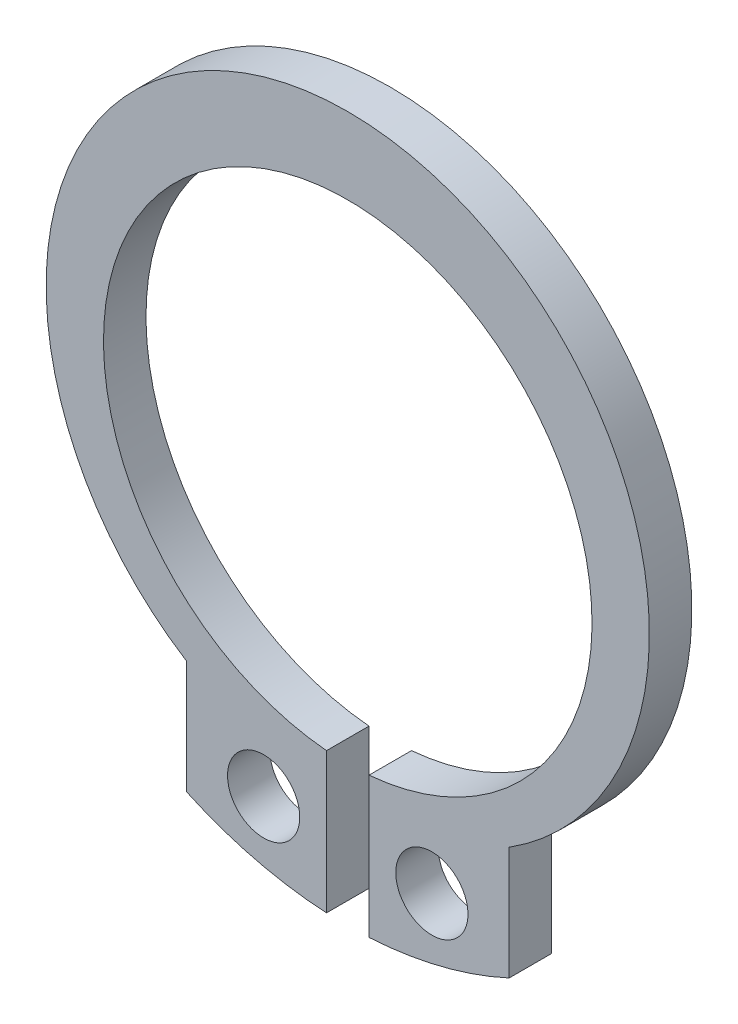
ISO-10303-21;
HEADER;
FILE_DESCRIPTION(('STEP AP214'),'2;1');
FILE_NAME('part.step','',(''),(''),'','','');
FILE_SCHEMA(('AUTOMOTIVE_DESIGN { 1 0 10303 214 1 1 1 1 }'));
ENDSEC;
DATA;
#1=APPLICATION_CONTEXT('core data for automotive mechanical design processes');
#2=APPLICATION_PROTOCOL_DEFINITION('international standard','automotive_design',2000,#1);
#3=PRODUCT_CONTEXT('',#1,'mechanical');
#4=PRODUCT('Part','Part','',(#3));
#5=PRODUCT_RELATED_PRODUCT_CATEGORY('part','',(#4));
#6=PRODUCT_DEFINITION_FORMATION('','',#4);
#7=PRODUCT_DEFINITION_CONTEXT('part definition',#1,'design');
#8=PRODUCT_DEFINITION('design','',#6,#7);
#9=PRODUCT_DEFINITION_SHAPE('','',#8);
#10=(LENGTH_UNIT() NAMED_UNIT(*) SI_UNIT(.MILLI.,.METRE.));
#11=(NAMED_UNIT(*) PLANE_ANGLE_UNIT() SI_UNIT($,.RADIAN.));
#12=(NAMED_UNIT(*) SI_UNIT($,.STERADIAN.) SOLID_ANGLE_UNIT());
#13=UNCERTAINTY_MEASURE_WITH_UNIT(LENGTH_MEASURE(1.E-05),#10,'distance_accuracy_value','');
#14=(GEOMETRIC_REPRESENTATION_CONTEXT(3) GLOBAL_UNCERTAINTY_ASSIGNED_CONTEXT((#13)) GLOBAL_UNIT_ASSIGNED_CONTEXT((#10,
#11,#12)) REPRESENTATION_CONTEXT('',''));
#15=CARTESIAN_POINT('',(0.,0.,0.));
#16=DIRECTION('',(0.,0.,1.));
#17=DIRECTION('',(1.,0.,0.));
#18=AXIS2_PLACEMENT_3D('',#15,#16,#17);
#19=CARTESIAN_POINT('',(0.,-1.25883475567706,0.));
#20=DIRECTION('',(0.,0.,1.));
#21=DIRECTION('',(1.,0.,0.));
#22=AXIS2_PLACEMENT_3D('',#19,#20,#21);
#23=PLANE('',#22);
#24=CARTESIAN_POINT('',(0.,0.,0.));
#25=DIRECTION('',(0.,0.,1.));
#26=DIRECTION('',(1.,0.,0.));
#27=AXIS2_PLACEMENT_3D('',#24,#25,#26);
#28=CIRCLE('',#27,5.75);
#29=CARTESIAN_POINT('',(0.5,-5.7282196186948,0.));
#30=VERTEX_POINT('',#29);
#31=CARTESIAN_POINT('',(-0.5,-5.7282196186948,0.));
#32=VERTEX_POINT('',#31);
#33=EDGE_CURVE('E11',#30,#32,#28,.T.);
#34=ORIENTED_EDGE('',*,*,#33,.T.);
#35=DIRECTION('',(0.,1.,0.));
#36=VECTOR('',#35,1.);
#37=CARTESIAN_POINT('',(-0.5,-9.03617728909742,0.));
#38=LINE('',#37,#36);
#39=CARTESIAN_POINT('',(-0.5,-9.03617728909742,0.));
#40=VERTEX_POINT('',#39);
#41=EDGE_CURVE('E129',#40,#32,#38,.T.);
#42=ORIENTED_EDGE('',*,*,#41,.F.);
#43=CARTESIAN_POINT('',(0.,0.,0.));
#44=DIRECTION('',(0.,0.,1.));
#45=DIRECTION('',(1.,0.,0.));
#46=AXIS2_PLACEMENT_3D('',#43,#44,#45);
#47=CIRCLE('',#46,9.05);
#48=CARTESIAN_POINT('',(-3.8,-8.21355586819741,0.));
#49=VERTEX_POINT('',#48);
#50=EDGE_CURVE('E119',#49,#40,#47,.T.);
#51=ORIENTED_EDGE('',*,*,#50,.F.);
#52=DIRECTION('',(0.,1.,0.));
#53=VECTOR('',#52,1.);
#54=CARTESIAN_POINT('',(-3.8,-8.21355586819741,0.));
#55=LINE('',#54,#53);
#56=CARTESIAN_POINT('',(-3.8,-5.54749947894954,0.));
#57=VERTEX_POINT('',#56);
#58=EDGE_CURVE('E135',#49,#57,#55,.T.);
#59=ORIENTED_EDGE('',*,*,#58,.T.);
#60=CARTESIAN_POINT('',(0.,0.45,0.));
#61=DIRECTION('',(0.,0.,1.));
#62=DIRECTION('',(1.,0.,0.));
#63=AXIS2_PLACEMENT_3D('',#60,#61,#62);
#64=CIRCLE('',#63,7.1);
#65=CARTESIAN_POINT('',(3.8,-5.54749947894954,0.));
#66=VERTEX_POINT('',#65);
#67=EDGE_CURVE('E100',#66,#57,#64,.T.);
#68=ORIENTED_EDGE('',*,*,#67,.F.);
#69=DIRECTION('',(0.,1.,0.));
#70=VECTOR('',#69,1.);
#71=CARTESIAN_POINT('',(3.8,-8.2135558681974,0.));
#72=LINE('',#71,#70);
#73=CARTESIAN_POINT('',(3.8,-8.2135558681974,0.));
#74=VERTEX_POINT('',#73);
#75=EDGE_CURVE('E97',#74,#66,#72,.T.);
#76=ORIENTED_EDGE('',*,*,#75,.F.);
#77=CARTESIAN_POINT('',(0.,0.,0.));
#78=DIRECTION('',(0.,0.,1.));
#79=DIRECTION('',(1.,0.,0.));
#80=AXIS2_PLACEMENT_3D('',#77,#78,#79);
#81=CIRCLE('',#80,9.05);
#82=CARTESIAN_POINT('',(0.5,-9.03617728909742,0.));
#83=VERTEX_POINT('',#82);
#84=EDGE_CURVE('E83',#83,#74,#81,.T.);
#85=ORIENTED_EDGE('',*,*,#84,.F.);
#86=DIRECTION('',(0.,1.,0.));
#87=VECTOR('',#86,1.);
#88=CARTESIAN_POINT('',(0.5,-9.03617728909742,0.));
#89=LINE('',#88,#87);
#90=EDGE_CURVE('E152',#83,#30,#89,.T.);
#91=ORIENTED_EDGE('',*,*,#90,.T.);
#92=EDGE_LOOP('',(#34,#42,#51,#59,#68,#76,#85,#91));
#93=FACE_BOUND('',#92,.T.);
#94=CARTESIAN_POINT('',(-1.98,-7.4,0.));
#95=DIRECTION('',(0.,0.,1.));
#96=DIRECTION('',(1.,0.,0.));
#97=AXIS2_PLACEMENT_3D('',#94,#95,#96);
#98=CIRCLE('',#97,0.85);
#99=CARTESIAN_POINT('',(-2.83,-7.4,0.));
#100=VERTEX_POINT('',#99);
#101=EDGE_CURVE('E20',#100,#100,#98,.T.);
#102=ORIENTED_EDGE('',*,*,#101,.T.);
#103=EDGE_LOOP('',(#102));
#104=FACE_BOUND('',#103,.T.);
#105=CARTESIAN_POINT('',(1.98,-7.4,0.));
#106=DIRECTION('',(0.,0.,1.));
#107=DIRECTION('',(1.,0.,0.));
#108=AXIS2_PLACEMENT_3D('',#105,#106,#107);
#109=CIRCLE('',#108,0.85);
#110=CARTESIAN_POINT('',(1.13,-7.4,0.));
#111=VERTEX_POINT('',#110);
#112=EDGE_CURVE('E131',#111,#111,#109,.T.);
#113=ORIENTED_EDGE('',*,*,#112,.T.);
#114=EDGE_LOOP('',(#113));
#115=FACE_BOUND('',#114,.T.);
#116=ADVANCED_FACE('F16',(#93,#104,#115),#23,.F.);
#117=CARTESIAN_POINT('',(0.,-1.25883475567706,1.));
#118=DIRECTION('',(0.,0.,1.));
#119=DIRECTION('',(1.,0.,0.));
#120=AXIS2_PLACEMENT_3D('',#117,#118,#119);
#121=PLANE('',#120);
#122=DIRECTION('',(0.,-1.,0.));
#123=VECTOR('',#122,1.);
#124=CARTESIAN_POINT('',(-0.5,-9.03617728909742,1.));
#125=LINE('',#124,#123);
#126=CARTESIAN_POINT('',(-0.5,-5.7282196186948,1.));
#127=VERTEX_POINT('',#126);
#128=CARTESIAN_POINT('',(-0.5,-9.03617728909742,1.));
#129=VERTEX_POINT('',#128);
#130=EDGE_CURVE('E120',#127,#129,#125,.T.);
#131=ORIENTED_EDGE('',*,*,#130,.F.);
#132=CARTESIAN_POINT('',(0.,0.,1.));
#133=DIRECTION('',(0.,0.,1.));
#134=DIRECTION('',(1.,0.,0.));
#135=AXIS2_PLACEMENT_3D('',#132,#133,#134);
#136=CIRCLE('',#135,5.75);
#137=CARTESIAN_POINT('',(0.5,-5.7282196186948,1.));
#138=VERTEX_POINT('',#137);
#139=EDGE_CURVE('E26',#138,#127,#136,.T.);
#140=ORIENTED_EDGE('',*,*,#139,.F.);
#141=DIRECTION('',(0.,1.,0.));
#142=VECTOR('',#141,1.);
#143=CARTESIAN_POINT('',(0.5,-9.03617728909742,1.));
#144=LINE('',#143,#142);
#145=CARTESIAN_POINT('',(0.5,-9.03617728909742,1.));
#146=VERTEX_POINT('',#145);
#147=EDGE_CURVE('E93',#146,#138,#144,.T.);
#148=ORIENTED_EDGE('',*,*,#147,.F.);
#149=CARTESIAN_POINT('',(0.,0.,1.));
#150=DIRECTION('',(0.,0.,-1.));
#151=DIRECTION('',(1.,0.,0.));
#152=AXIS2_PLACEMENT_3D('',#149,#150,#151);
#153=CIRCLE('',#152,9.05);
#154=CARTESIAN_POINT('',(3.8,-8.2135558681974,1.));
#155=VERTEX_POINT('',#154);
#156=EDGE_CURVE('E104',#155,#146,#153,.T.);
#157=ORIENTED_EDGE('',*,*,#156,.F.);
#158=DIRECTION('',(0.,-1.,0.));
#159=VECTOR('',#158,1.);
#160=CARTESIAN_POINT('',(3.8,-8.2135558681974,1.));
#161=LINE('',#160,#159);
#162=CARTESIAN_POINT('',(3.8,-5.54749947894954,1.));
#163=VERTEX_POINT('',#162);
#164=EDGE_CURVE('E106',#163,#155,#161,.T.);
#165=ORIENTED_EDGE('',*,*,#164,.F.);
#166=CARTESIAN_POINT('',(0.,0.45,1.));
#167=DIRECTION('',(0.,0.,-1.));
#168=DIRECTION('',(1.,0.,0.));
#169=AXIS2_PLACEMENT_3D('',#166,#167,#168);
#170=CIRCLE('',#169,7.1);
#171=CARTESIAN_POINT('',(-3.8,-5.54749947894954,1.));
#172=VERTEX_POINT('',#171);
#173=EDGE_CURVE('E111',#172,#163,#170,.T.);
#174=ORIENTED_EDGE('',*,*,#173,.F.);
#175=DIRECTION('',(0.,1.,0.));
#176=VECTOR('',#175,1.);
#177=CARTESIAN_POINT('',(-3.8,-8.21355586819741,1.));
#178=LINE('',#177,#176);
#179=CARTESIAN_POINT('',(-3.8,-8.21355586819741,1.));
#180=VERTEX_POINT('',#179);
#181=EDGE_CURVE('E115',#180,#172,#178,.T.);
#182=ORIENTED_EDGE('',*,*,#181,.F.);
#183=CARTESIAN_POINT('',(0.,0.,1.));
#184=DIRECTION('',(0.,0.,-1.));
#185=DIRECTION('',(1.,0.,0.));
#186=AXIS2_PLACEMENT_3D('',#183,#184,#185);
#187=CIRCLE('',#186,9.05);
#188=EDGE_CURVE('E128',#129,#180,#187,.T.);
#189=ORIENTED_EDGE('',*,*,#188,.F.);
#190=EDGE_LOOP('',(#131,#140,#148,#157,#165,#174,#182,#189));
#191=FACE_BOUND('',#190,.T.);
#192=CARTESIAN_POINT('',(-1.98,-7.4,1.));
#193=DIRECTION('',(0.,0.,-1.));
#194=DIRECTION('',(1.,0.,0.));
#195=AXIS2_PLACEMENT_3D('',#192,#193,#194);
#196=CIRCLE('',#195,0.85);
#197=CARTESIAN_POINT('',(-2.83,-7.4,1.));
#198=VERTEX_POINT('',#197);
#199=EDGE_CURVE('E124',#198,#198,#196,.T.);
#200=ORIENTED_EDGE('',*,*,#199,.T.);
#201=EDGE_LOOP('',(#200));
#202=FACE_BOUND('',#201,.T.);
#203=CARTESIAN_POINT('',(1.98,-7.4,1.));
#204=DIRECTION('',(0.,0.,-1.));
#205=DIRECTION('',(1.,0.,0.));
#206=AXIS2_PLACEMENT_3D('',#203,#204,#205);
#207=CIRCLE('',#206,0.85);
#208=CARTESIAN_POINT('',(1.13,-7.4,1.));
#209=VERTEX_POINT('',#208);
#210=EDGE_CURVE('E134',#209,#209,#207,.T.);
#211=ORIENTED_EDGE('',*,*,#210,.T.);
#212=EDGE_LOOP('',(#211));
#213=FACE_BOUND('',#212,.T.);
#214=ADVANCED_FACE('F166',(#191,#202,#213),#121,.T.);
#215=CARTESIAN_POINT('',(0.,0.,0.));
#216=DIRECTION('',(0.,0.,-1.));
#217=DIRECTION('',(1.,0.,0.));
#218=AXIS2_PLACEMENT_3D('',#215,#216,#217);
#219=CYLINDRICAL_SURFACE('',#218,5.75);
#220=ORIENTED_EDGE('',*,*,#139,.T.);
#221=DIRECTION('',(0.,0.,1.));
#222=VECTOR('',#221,1.);
#223=CARTESIAN_POINT('',(-0.5,-5.7282196186948,0.));
#224=LINE('',#223,#222);
#225=EDGE_CURVE('E125',#32,#127,#224,.T.);
#226=ORIENTED_EDGE('',*,*,#225,.F.);
#227=ORIENTED_EDGE('',*,*,#33,.F.);
#228=DIRECTION('',(0.,0.,1.));
#229=VECTOR('',#228,1.);
#230=CARTESIAN_POINT('',(0.5,-5.7282196186948,0.));
#231=LINE('',#230,#229);
#232=EDGE_CURVE('E150',#30,#138,#231,.T.);
#233=ORIENTED_EDGE('',*,*,#232,.T.);
#234=EDGE_LOOP('',(#220,#226,#227,#233));
#235=FACE_BOUND('',#234,.T.);
#236=ADVANCED_FACE('F158',(#235),#219,.F.);
#237=CARTESIAN_POINT('',(0.5,-7.38219845389611,0.));
#238=DIRECTION('',(-1.,0.,0.));
#239=DIRECTION('',(0.,-1.,0.));
#240=AXIS2_PLACEMENT_3D('',#237,#238,#239);
#241=PLANE('',#240);
#242=ORIENTED_EDGE('',*,*,#147,.T.);
#243=ORIENTED_EDGE('',*,*,#232,.F.);
#244=ORIENTED_EDGE('',*,*,#90,.F.);
#245=DIRECTION('',(0.,0.,1.));
#246=VECTOR('',#245,1.);
#247=CARTESIAN_POINT('',(0.5,-9.03617728909742,0.));
#248=LINE('',#247,#246);
#249=EDGE_CURVE('E91',#83,#146,#248,.T.);
#250=ORIENTED_EDGE('',*,*,#249,.T.);
#251=EDGE_LOOP('',(#242,#243,#244,#250));
#252=FACE_BOUND('',#251,.T.);
#253=ADVANCED_FACE('F174',(#252),#241,.T.);
#254=CARTESIAN_POINT('',(0.,0.,0.));
#255=DIRECTION('',(0.,0.,-1.));
#256=DIRECTION('',(1.,0.,0.));
#257=AXIS2_PLACEMENT_3D('',#254,#255,#256);
#258=CYLINDRICAL_SURFACE('',#257,9.05);
#259=ORIENTED_EDGE('',*,*,#156,.T.);
#260=ORIENTED_EDGE('',*,*,#249,.F.);
#261=ORIENTED_EDGE('',*,*,#84,.T.);
#262=DIRECTION('',(0.,0.,1.));
#263=VECTOR('',#262,1.);
#264=CARTESIAN_POINT('',(3.8,-8.2135558681974,0.));
#265=LINE('',#264,#263);
#266=EDGE_CURVE('E88',#74,#155,#265,.T.);
#267=ORIENTED_EDGE('',*,*,#266,.T.);
#268=EDGE_LOOP('',(#259,#260,#261,#267));
#269=FACE_BOUND('',#268,.T.);
#270=ADVANCED_FACE('F86',(#269),#258,.T.);
#271=CARTESIAN_POINT('',(3.8,-6.88052767357347,0.));
#272=DIRECTION('',(1.,0.,0.));
#273=DIRECTION('',(0.,1.,0.));
#274=AXIS2_PLACEMENT_3D('',#271,#272,#273);
#275=PLANE('',#274);
#276=ORIENTED_EDGE('',*,*,#164,.T.);
#277=ORIENTED_EDGE('',*,*,#266,.F.);
#278=ORIENTED_EDGE('',*,*,#75,.T.);
#279=DIRECTION('',(0.,0.,1.));
#280=VECTOR('',#279,1.);
#281=CARTESIAN_POINT('',(3.8,-5.54749947894954,0.));
#282=LINE('',#281,#280);
#283=EDGE_CURVE('E113',#66,#163,#282,.T.);
#284=ORIENTED_EDGE('',*,*,#283,.T.);
#285=EDGE_LOOP('',(#276,#277,#278,#284));
#286=FACE_BOUND('',#285,.T.);
#287=ADVANCED_FACE('F18',(#286),#275,.T.);
#288=CARTESIAN_POINT('',(0.,0.45,0.));
#289=DIRECTION('',(0.,0.,-1.));
#290=DIRECTION('',(1.,0.,0.));
#291=AXIS2_PLACEMENT_3D('',#288,#289,#290);
#292=CYLINDRICAL_SURFACE('',#291,7.1);
#293=ORIENTED_EDGE('',*,*,#173,.T.);
#294=ORIENTED_EDGE('',*,*,#283,.F.);
#295=ORIENTED_EDGE('',*,*,#67,.T.);
#296=DIRECTION('',(0.,0.,1.));
#297=VECTOR('',#296,1.);
#298=CARTESIAN_POINT('',(-3.8,-5.54749947894954,0.));
#299=LINE('',#298,#297);
#300=EDGE_CURVE('E118',#57,#172,#299,.T.);
#301=ORIENTED_EDGE('',*,*,#300,.T.);
#302=EDGE_LOOP('',(#293,#294,#295,#301));
#303=FACE_BOUND('',#302,.T.);
#304=ADVANCED_FACE('F177',(#303),#292,.T.);
#305=CARTESIAN_POINT('',(-3.8,-6.88052767357347,0.));
#306=DIRECTION('',(-1.,0.,0.));
#307=DIRECTION('',(0.,-1.,0.));
#308=AXIS2_PLACEMENT_3D('',#305,#306,#307);
#309=PLANE('',#308);
#310=ORIENTED_EDGE('',*,*,#181,.T.);
#311=ORIENTED_EDGE('',*,*,#300,.F.);
#312=ORIENTED_EDGE('',*,*,#58,.F.);
#313=DIRECTION('',(0.,0.,1.));
#314=VECTOR('',#313,1.);
#315=CARTESIAN_POINT('',(-3.8,-8.21355586819741,0.));
#316=LINE('',#315,#314);
#317=EDGE_CURVE('E142',#49,#180,#316,.T.);
#318=ORIENTED_EDGE('',*,*,#317,.T.);
#319=EDGE_LOOP('',(#310,#311,#312,#318));
#320=FACE_BOUND('',#319,.T.);
#321=ADVANCED_FACE('F180',(#320),#309,.T.);
#322=CARTESIAN_POINT('',(0.,0.,0.));
#323=DIRECTION('',(0.,0.,-1.));
#324=DIRECTION('',(1.,0.,0.));
#325=AXIS2_PLACEMENT_3D('',#322,#323,#324);
#326=CYLINDRICAL_SURFACE('',#325,9.05);
#327=ORIENTED_EDGE('',*,*,#188,.T.);
#328=ORIENTED_EDGE('',*,*,#317,.F.);
#329=ORIENTED_EDGE('',*,*,#50,.T.);
#330=DIRECTION('',(0.,0.,1.));
#331=VECTOR('',#330,1.);
#332=CARTESIAN_POINT('',(-0.5,-9.03617728909742,0.));
#333=LINE('',#332,#331);
#334=EDGE_CURVE('E123',#40,#129,#333,.T.);
#335=ORIENTED_EDGE('',*,*,#334,.T.);
#336=EDGE_LOOP('',(#327,#328,#329,#335));
#337=FACE_BOUND('',#336,.T.);
#338=ADVANCED_FACE('F171',(#337),#326,.T.);
#339=CARTESIAN_POINT('',(-0.5,-7.38219845389611,0.));
#340=DIRECTION('',(1.,0.,0.));
#341=DIRECTION('',(0.,1.,0.));
#342=AXIS2_PLACEMENT_3D('',#339,#340,#341);
#343=PLANE('',#342);
#344=ORIENTED_EDGE('',*,*,#130,.T.);
#345=ORIENTED_EDGE('',*,*,#334,.F.);
#346=ORIENTED_EDGE('',*,*,#41,.T.);
#347=ORIENTED_EDGE('',*,*,#225,.T.);
#348=EDGE_LOOP('',(#344,#345,#346,#347));
#349=FACE_BOUND('',#348,.T.);
#350=ADVANCED_FACE('F163',(#349),#343,.T.);
#351=CARTESIAN_POINT('',(-1.98,-7.4,0.5));
#352=DIRECTION('',(0.,0.,-1.));
#353=DIRECTION('',(1.,0.,0.));
#354=AXIS2_PLACEMENT_3D('',#351,#352,#353);
#355=CYLINDRICAL_SURFACE('',#354,0.85);
#356=ORIENTED_EDGE('',*,*,#199,.F.);
#357=EDGE_LOOP('',(#356));
#358=FACE_BOUND('',#357,.T.);
#359=ORIENTED_EDGE('',*,*,#101,.F.);
#360=EDGE_LOOP('',(#359));
#361=FACE_BOUND('',#360,.T.);
#362=ADVANCED_FACE('F198',(#358,#361),#355,.F.);
#363=CARTESIAN_POINT('',(1.98,-7.4,0.5));
#364=DIRECTION('',(0.,0.,-1.));
#365=DIRECTION('',(1.,0.,0.));
#366=AXIS2_PLACEMENT_3D('',#363,#364,#365);
#367=CYLINDRICAL_SURFACE('',#366,0.85);
#368=ORIENTED_EDGE('',*,*,#210,.F.);
#369=EDGE_LOOP('',(#368));
#370=FACE_BOUND('',#369,.T.);
#371=ORIENTED_EDGE('',*,*,#112,.F.);
#372=EDGE_LOOP('',(#371));
#373=FACE_BOUND('',#372,.T.);
#374=ADVANCED_FACE('F201',(#370,#373),#367,.F.);
#375=CLOSED_SHELL('',(#116,#214,#236,#253,#270,#287,#304,#321,#338,#350,#362,#374));
#376=MANIFOLD_SOLID_BREP('B1',#375);
#377=ADVANCED_BREP_SHAPE_REPRESENTATION('',(#18,#376),#14);
#378=SHAPE_DEFINITION_REPRESENTATION(#9,#377);
ENDSEC;
END-ISO-10303-21;
